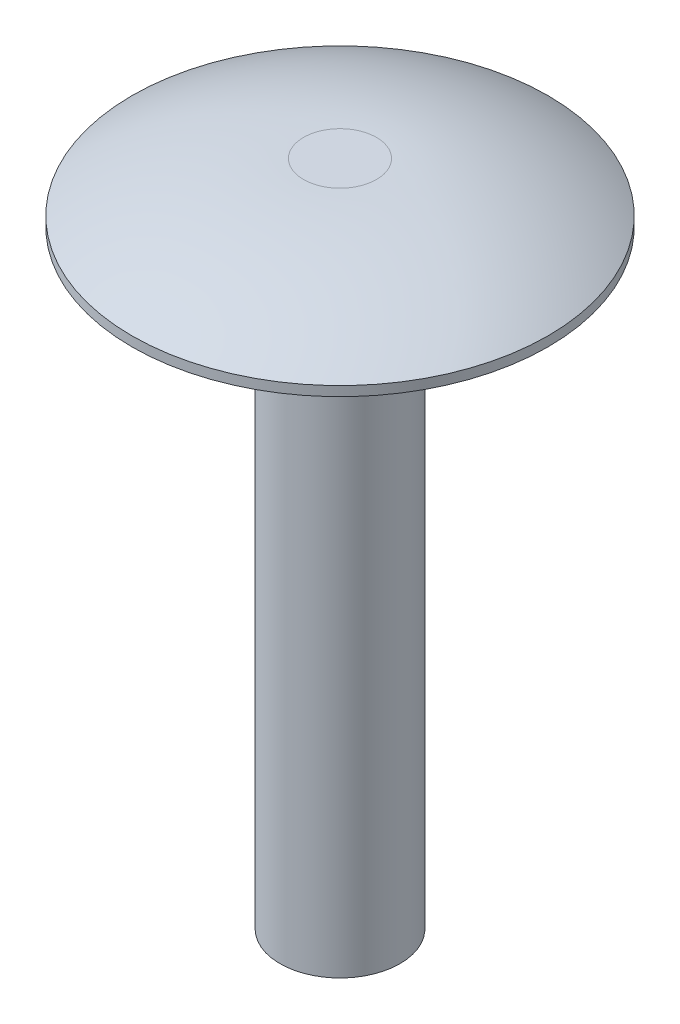
ISO-10303-21;
HEADER;
FILE_DESCRIPTION(('STEP AP214'),'2;1');
FILE_NAME('part.step','',(''),(''),'','','');
FILE_SCHEMA(('AUTOMOTIVE_DESIGN { 1 0 10303 214 1 1 1 1 }'));
ENDSEC;
DATA;
#1=APPLICATION_CONTEXT('core data for automotive mechanical design processes');
#2=APPLICATION_PROTOCOL_DEFINITION('international standard','automotive_design',2000,#1);
#3=PRODUCT_CONTEXT('',#1,'mechanical');
#4=PRODUCT('Part','Part','',(#3));
#5=PRODUCT_RELATED_PRODUCT_CATEGORY('part','',(#4));
#6=PRODUCT_DEFINITION_FORMATION('','',#4);
#7=PRODUCT_DEFINITION_CONTEXT('part definition',#1,'design');
#8=PRODUCT_DEFINITION('design','',#6,#7);
#9=PRODUCT_DEFINITION_SHAPE('','',#8);
#10=(LENGTH_UNIT() NAMED_UNIT(*) SI_UNIT(.MILLI.,.METRE.));
#11=(NAMED_UNIT(*) PLANE_ANGLE_UNIT() SI_UNIT($,.RADIAN.));
#12=(NAMED_UNIT(*) SI_UNIT($,.STERADIAN.) SOLID_ANGLE_UNIT());
#13=UNCERTAINTY_MEASURE_WITH_UNIT(LENGTH_MEASURE(1.E-05),#10,'distance_accuracy_value','');
#14=(GEOMETRIC_REPRESENTATION_CONTEXT(3) GLOBAL_UNCERTAINTY_ASSIGNED_CONTEXT((#13)) GLOBAL_UNIT_ASSIGNED_CONTEXT((#10,
#11,#12)) REPRESENTATION_CONTEXT('',''));
#15=CARTESIAN_POINT('',(0.,0.,0.));
#16=DIRECTION('',(0.,0.,1.));
#17=DIRECTION('',(1.,0.,0.));
#18=AXIS2_PLACEMENT_3D('',#15,#16,#17);
#19=CARTESIAN_POINT('',(0.,0.,0.));
#20=DIRECTION('',(0.,1.,0.));
#21=DIRECTION('',(-1.,0.,0.));
#22=AXIS2_PLACEMENT_3D('',#19,#20,#21);
#23=PLANE('',#22);
#24=CARTESIAN_POINT('',(0.,0.,0.));
#25=DIRECTION('',(0.,-1.,0.));
#26=DIRECTION('',(1.,0.,0.));
#27=AXIS2_PLACEMENT_3D('',#24,#25,#26);
#28=CIRCLE('',#27,2.38125);
#29=CARTESIAN_POINT('',(2.38125,0.,0.));
#30=VERTEX_POINT('',#29);
#31=EDGE_CURVE('E10',#30,#30,#28,.T.);
#32=ORIENTED_EDGE('',*,*,#31,.T.);
#33=EDGE_LOOP('',(#32));
#34=FACE_BOUND('',#33,.T.);
#35=ADVANCED_FACE('F32',(#34),#23,.F.);
#36=CARTESIAN_POINT('',(0.,0.,0.));
#37=DIRECTION('',(0.,-1.,0.));
#38=DIRECTION('',(1.,0.,0.));
#39=AXIS2_PLACEMENT_3D('',#36,#37,#38);
#40=CYLINDRICAL_SURFACE('',#39,2.38125);
#41=ORIENTED_EDGE('',*,*,#31,.F.);
#42=EDGE_LOOP('',(#41));
#43=FACE_BOUND('',#42,.T.);
#44=CARTESIAN_POINT('',(0.,24.13,0.));
#45=DIRECTION('',(0.,-1.,0.));
#46=DIRECTION('',(1.,0.,0.));
#47=AXIS2_PLACEMENT_3D('',#44,#45,#46);
#48=CIRCLE('',#47,2.38125);
#49=CARTESIAN_POINT('',(2.38125,24.13,0.));
#50=VERTEX_POINT('',#49);
#51=EDGE_CURVE('E38',#50,#50,#48,.T.);
#52=ORIENTED_EDGE('',*,*,#51,.T.);
#53=EDGE_LOOP('',(#52));
#54=FACE_BOUND('',#53,.T.);
#55=ADVANCED_FACE('F67',(#43,#54),#40,.T.);
#56=CARTESIAN_POINT('',(-2.38125,24.13,0.));
#57=DIRECTION('',(0.,1.,0.));
#58=DIRECTION('',(-1.,0.,0.));
#59=AXIS2_PLACEMENT_3D('',#56,#57,#58);
#60=PLANE('',#59);
#61=ORIENTED_EDGE('',*,*,#51,.F.);
#62=EDGE_LOOP('',(#61));
#63=FACE_BOUND('',#62,.T.);
#64=CARTESIAN_POINT('',(0.,24.13,0.));
#65=DIRECTION('',(0.,-1.,0.));
#66=DIRECTION('',(1.,0.,0.));
#67=AXIS2_PLACEMENT_3D('',#64,#65,#66);
#68=CIRCLE('',#67,8.255);
#69=CARTESIAN_POINT('',(8.255,24.13,0.));
#70=VERTEX_POINT('',#69);
#71=EDGE_CURVE('E42',#70,#70,#68,.T.);
#72=ORIENTED_EDGE('',*,*,#71,.T.);
#73=EDGE_LOOP('',(#72));
#74=FACE_BOUND('',#73,.T.);
#75=ADVANCED_FACE('F71',(#63,#74),#60,.F.);
#76=CARTESIAN_POINT('',(0.,0.,0.));
#77=DIRECTION('',(0.,-1.,0.));
#78=DIRECTION('',(1.,0.,0.));
#79=AXIS2_PLACEMENT_3D('',#76,#77,#78);
#80=CYLINDRICAL_SURFACE('',#79,8.255);
#81=ORIENTED_EDGE('',*,*,#71,.F.);
#82=EDGE_LOOP('',(#81));
#83=FACE_BOUND('',#82,.T.);
#84=CARTESIAN_POINT('',(0.,24.511,0.));
#85=DIRECTION('',(0.,-1.,0.));
#86=DIRECTION('',(1.,0.,0.));
#87=AXIS2_PLACEMENT_3D('',#84,#85,#86);
#88=CIRCLE('',#87,8.255);
#89=CARTESIAN_POINT('',(8.255,24.511,0.));
#90=VERTEX_POINT('',#89);
#91=EDGE_CURVE('E46',#90,#90,#88,.T.);
#92=ORIENTED_EDGE('',*,*,#91,.T.);
#93=EDGE_LOOP('',(#92));
#94=FACE_BOUND('',#93,.T.);
#95=ADVANCED_FACE('F63',(#83,#94),#80,.T.);
#96=CARTESIAN_POINT('',(0.,13.7253816129032,0.));
#97=DIRECTION('',(0.,-1.,0.));
#98=DIRECTION('',(1.,0.,0.));
#99=AXIS2_PLACEMENT_3D('',#96,#97,#98);
#100=DEGENERATE_TOROIDAL_SURFACE('',#99,1.4478,12.7541183870968,.T.);
#101=ORIENTED_EDGE('',*,*,#91,.F.);
#102=EDGE_LOOP('',(#101));
#103=FACE_BOUND('',#102,.T.);
#104=CARTESIAN_POINT('',(0.,26.4795,0.));
#105=DIRECTION('',(0.,-1.,0.));
#106=DIRECTION('',(1.,0.,0.));
#107=AXIS2_PLACEMENT_3D('',#104,#105,#106);
#108=CIRCLE('',#107,1.4478);
#109=CARTESIAN_POINT('',(1.4478,26.4795,0.));
#110=VERTEX_POINT('',#109);
#111=EDGE_CURVE('E51',#110,#110,#108,.T.);
#112=ORIENTED_EDGE('',*,*,#111,.T.);
#113=EDGE_LOOP('',(#112));
#114=FACE_BOUND('',#113,.T.);
#115=ADVANCED_FACE('F55',(#103,#114),#100,.T.);
#116=CARTESIAN_POINT('',(-1.4478,26.4795,0.));
#117=DIRECTION('',(0.,-1.,0.));
#118=DIRECTION('',(1.,0.,0.));
#119=AXIS2_PLACEMENT_3D('',#116,#117,#118);
#120=PLANE('',#119);
#121=ORIENTED_EDGE('',*,*,#111,.F.);
#122=EDGE_LOOP('',(#121));
#123=FACE_BOUND('',#122,.T.);
#124=ADVANCED_FACE('F57',(#123),#120,.F.);
#125=CLOSED_SHELL('',(#35,#55,#75,#95,#115,#124));
#126=MANIFOLD_SOLID_BREP('B2',#125);
#127=ADVANCED_BREP_SHAPE_REPRESENTATION('',(#18,#126),#14);
#128=SHAPE_DEFINITION_REPRESENTATION(#9,#127);
ENDSEC;
END-ISO-10303-21;
